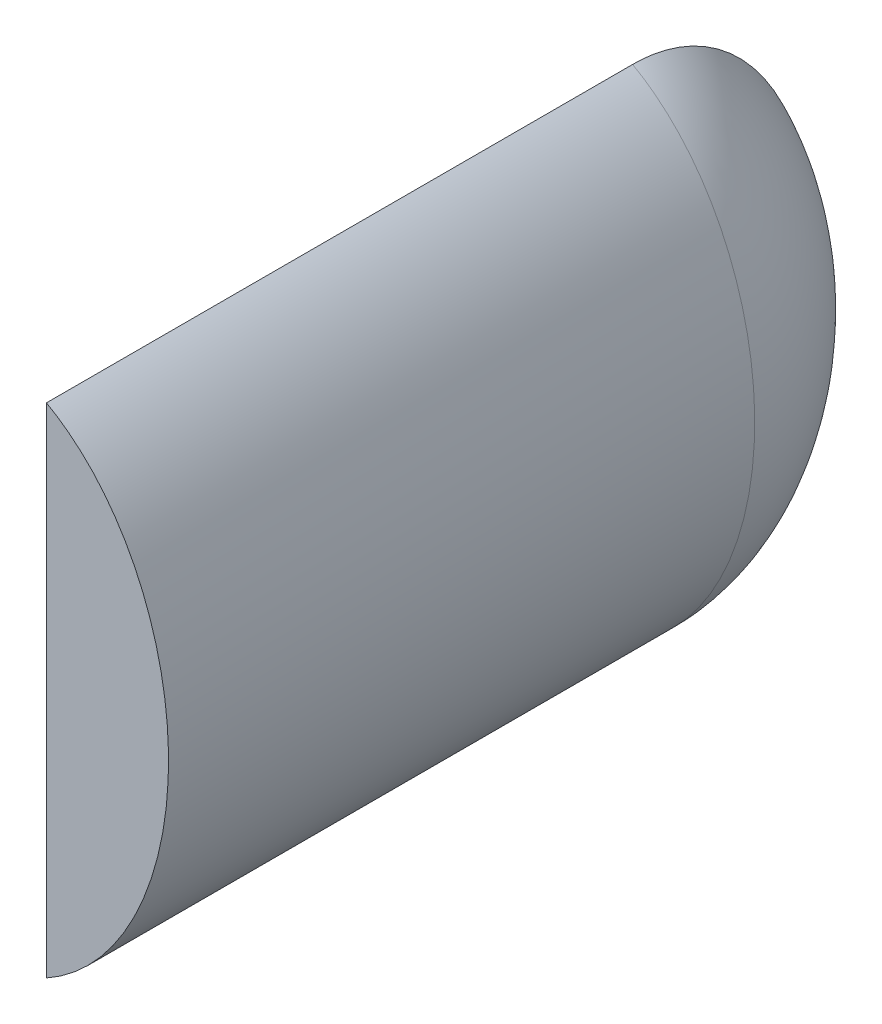
ISO-10303-21;
HEADER;
FILE_DESCRIPTION(('STEP AP214'),'2;1');
FILE_NAME('part.step','',(''),(''),'','','');
FILE_SCHEMA(('AUTOMOTIVE_DESIGN { 1 0 10303 214 1 1 1 1 }'));
ENDSEC;
DATA;
#1=APPLICATION_CONTEXT('core data for automotive mechanical design processes');
#2=APPLICATION_PROTOCOL_DEFINITION('international standard','automotive_design',2000,#1);
#3=PRODUCT_CONTEXT('',#1,'mechanical');
#4=PRODUCT('Part','Part','',(#3));
#5=PRODUCT_RELATED_PRODUCT_CATEGORY('part','',(#4));
#6=PRODUCT_DEFINITION_FORMATION('','',#4);
#7=PRODUCT_DEFINITION_CONTEXT('part definition',#1,'design');
#8=PRODUCT_DEFINITION('design','',#6,#7);
#9=PRODUCT_DEFINITION_SHAPE('','',#8);
#10=(LENGTH_UNIT() NAMED_UNIT(*) SI_UNIT(.MILLI.,.METRE.));
#11=(NAMED_UNIT(*) PLANE_ANGLE_UNIT() SI_UNIT($,.RADIAN.));
#12=(NAMED_UNIT(*) SI_UNIT($,.STERADIAN.) SOLID_ANGLE_UNIT());
#13=UNCERTAINTY_MEASURE_WITH_UNIT(LENGTH_MEASURE(1.E-05),#10,'distance_accuracy_value','');
#14=(GEOMETRIC_REPRESENTATION_CONTEXT(3) GLOBAL_UNCERTAINTY_ASSIGNED_CONTEXT((#13)) GLOBAL_UNIT_ASSIGNED_CONTEXT((#10,
#11,#12)) REPRESENTATION_CONTEXT('',''));
#15=CARTESIAN_POINT('',(0.,0.,0.));
#16=DIRECTION('',(0.,0.,1.));
#17=DIRECTION('',(1.,0.,0.));
#18=AXIS2_PLACEMENT_3D('',#15,#16,#17);
#19=CARTESIAN_POINT('',(15.,0.,0.));
#20=DIRECTION('',(1.,0.,0.));
#21=DIRECTION('',(0.,0.,-1.));
#22=AXIS2_PLACEMENT_3D('',#19,#20,#21);
#23=PLANE('',#22);
#24=DIRECTION('',(0.,0.,1.));
#25=VECTOR('',#24,1.);
#26=CARTESIAN_POINT('',(15.,-50.9863645987827,-120.));
#27=LINE('',#26,#25);
#28=CARTESIAN_POINT('',(15.,-50.9863645987827,-120.));
#29=VERTEX_POINT('',#28);
#30=CARTESIAN_POINT('',(15.,-50.9863645987827,0.));
#31=VERTEX_POINT('',#30);
#32=EDGE_CURVE('E45',#29,#31,#27,.T.);
#33=ORIENTED_EDGE('',*,*,#32,.T.);
#34=DIRECTION('',(0.,1.,0.));
#35=VECTOR('',#34,1.);
#36=CARTESIAN_POINT('',(15.,0.,0.));
#37=LINE('',#36,#35);
#38=CARTESIAN_POINT('',(15.,50.9863645987827,0.));
#39=VERTEX_POINT('',#38);
#40=EDGE_CURVE('E11',#31,#39,#37,.T.);
#41=ORIENTED_EDGE('',*,*,#40,.T.);
#42=DIRECTION('',(0.,0.,1.));
#43=VECTOR('',#42,1.);
#44=CARTESIAN_POINT('',(15.,50.9863645987827,-120.));
#45=LINE('',#44,#43);
#46=CARTESIAN_POINT('',(15.,50.9863645987827,-120.));
#47=VERTEX_POINT('',#46);
#48=EDGE_CURVE('E58',#39,#47,#45,.F.);
#49=ORIENTED_EDGE('',*,*,#48,.T.);
#50=CARTESIAN_POINT('',(15.,-50.9863645987827,-120.));
#51=CARTESIAN_POINT('',(15.,-50.9863659150804,-120.271161514491));
#52=CARTESIAN_POINT('',(15.,-50.9822743336061,-120.542306159468));
#53=CARTESIAN_POINT('',(15.,-50.965922837957,-121.084346800252));
#54=CARTESIAN_POINT('',(15.,-50.9536629928537,-121.355242798143));
#55=CARTESIAN_POINT('',(15.,-50.9046811999531,-122.166843879696));
#56=CARTESIAN_POINT('',(15.,-50.8557569363576,-122.706861864835));
#57=CARTESIAN_POINT('',(15.,-50.7257913423353,-123.782862469057));
#58=CARTESIAN_POINT('',(15.,-50.6447567013706,-124.318845904962));
#59=CARTESIAN_POINT('',(15.,-50.4519432582784,-125.381314381962));
#60=CARTESIAN_POINT('',(15.,-50.3403872606537,-125.907839868435));
#61=CARTESIAN_POINT('',(15.,-50.0871698770449,-126.953650190733));
#62=CARTESIAN_POINT('',(15.,-49.945505098991,-127.4729342037));
#63=CARTESIAN_POINT('',(15.,-49.6331609206117,-128.502696390934));
#64=CARTESIAN_POINT('',(15.,-49.4624811148031,-129.013174442028));
#65=CARTESIAN_POINT('',(15.,-49.0937680987219,-130.022808794033));
#66=CARTESIAN_POINT('',(15.,-48.8957986564226,-130.52198841931));
#67=CARTESIAN_POINT('',(15.,-48.4735499645837,-131.50906343519));
#68=CARTESIAN_POINT('',(15.,-48.2492713099622,-131.996959080654));
#69=CARTESIAN_POINT('',(15.,-47.7758176133993,-132.960470298102));
#70=CARTESIAN_POINT('',(15.,-47.5266438219397,-133.436086485374));
#71=CARTESIAN_POINT('',(15.,-47.0043837486491,-134.375057751137));
#72=CARTESIAN_POINT('',(15.,-46.7312569695623,-134.838390270198));
#73=CARTESIAN_POINT('',(15.,-46.1628988928502,-135.751303292431));
#74=CARTESIAN_POINT('',(15.,-45.8676670614398,-136.200883463147));
#75=CARTESIAN_POINT('',(15.,-45.2565331526422,-137.08579129184));
#76=CARTESIAN_POINT('',(15.,-44.9406283343639,-137.521117048393));
#77=CARTESIAN_POINT('',(15.,-43.9276212878261,-138.852914958976));
#78=CARTESIAN_POINT('',(15.,-43.1970484575742,-139.724212667999));
#79=CARTESIAN_POINT('',(15.,-41.6623561681202,-141.399307441977));
#80=CARTESIAN_POINT('',(15.,-40.8582125209794,-142.203082139527));
#81=CARTESIAN_POINT('',(15.,-39.1862312354968,-143.743776286257));
#82=CARTESIAN_POINT('',(15.,-38.3183027287411,-144.480596876671));
#83=CARTESIAN_POINT('',(15.,-36.5295375571028,-145.886588056753));
#84=CARTESIAN_POINT('',(15.,-35.6086996379795,-146.555757041671));
#85=CARTESIAN_POINT('',(15.,-33.3917139931399,-148.050674904412));
#86=CARTESIAN_POINT('',(15.,-32.0771130208873,-148.849134853375));
#87=CARTESIAN_POINT('',(15.,-29.3834631546804,-150.328860060758));
#88=CARTESIAN_POINT('',(15.,-28.0043917427083,-151.010083976551));
#89=CARTESIAN_POINT('',(15.,-25.1947058469138,-152.259690322041));
#90=CARTESIAN_POINT('',(15.,-23.7640447259047,-152.827967464834));
#91=CARTESIAN_POINT('',(15.,-20.8641465225682,-153.854502689836));
#92=CARTESIAN_POINT('',(15.,-19.3949134372143,-154.312772121932));
#93=CARTESIAN_POINT('',(15.,-16.3900909943441,-155.132720076065));
#94=CARTESIAN_POINT('',(15.,-14.8537620935086,-155.491679567055));
#95=CARTESIAN_POINT('',(15.,-11.7595395006699,-156.100072774864));
#96=CARTESIAN_POINT('',(15.,-10.2016439950094,-156.349497221834));
#97=CARTESIAN_POINT('',(15.,-7.07495705764748,-156.740350126199));
#98=CARTESIAN_POINT('',(15.,-5.50618725920234,-156.881952164787));
#99=CARTESIAN_POINT('',(15.,-2.36304993871342,-157.058877807957));
#100=CARTESIAN_POINT('',(15.,-0.788683565493083,-157.094222090644));
#101=CARTESIAN_POINT('',(15.,2.67030566299415,-157.055482299435));
#102=CARTESIAN_POINT('',(15.,4.55471468743005,-156.958376092501));
#103=CARTESIAN_POINT('',(15.,8.31145838160758,-156.610927943543));
#104=CARTESIAN_POINT('',(15.,10.1837778196358,-156.360420682411));
#105=CARTESIAN_POINT('',(15.,13.8187907961272,-155.717851907121));
#106=CARTESIAN_POINT('',(15.,15.5826749898813,-155.332527605223));
#107=CARTESIAN_POINT('',(15.,19.073289952585,-154.415170127074));
#108=CARTESIAN_POINT('',(15.,20.8000034905659,-153.883070425363));
#109=CARTESIAN_POINT('',(15.,23.3488662050943,-152.971499933035));
#110=CARTESIAN_POINT('',(15.,24.1916190823228,-152.648739656397));
#111=CARTESIAN_POINT('',(15.,25.8614021816744,-151.964571920841));
#112=CARTESIAN_POINT('',(15.,26.6884320009616,-151.603163473298));
#113=CARTESIAN_POINT('',(15.,28.3237033620683,-150.841162648469));
#114=CARTESIAN_POINT('',(15.,29.1319552099297,-150.440592424973));
#115=CARTESIAN_POINT('',(15.,30.7272075977969,-149.599363980685));
#116=CARTESIAN_POINT('',(15.,31.5142101347248,-149.158709543965));
#117=CARTESIAN_POINT('',(15.,33.2760544644224,-148.110192116555));
#118=CARTESIAN_POINT('',(15.,34.2433863512131,-147.48956390627));
#119=CARTESIAN_POINT('',(15.,35.6588109126154,-146.507904097051));
#120=CARTESIAN_POINT('',(15.,36.1246676753095,-146.17224941034));
#121=CARTESIAN_POINT('',(15.,37.043726609915,-145.48369349881));
#122=CARTESIAN_POINT('',(15.,37.4969240869991,-145.130786005619));
#123=CARTESIAN_POINT('',(15.,38.8344130526019,-144.047094310885));
#124=CARTESIAN_POINT('',(15.,39.6979692833804,-143.290397221608));
#125=CARTESIAN_POINT('',(15.,41.3589165422492,-141.707858090598));
#126=CARTESIAN_POINT('',(15.,42.1563353679782,-140.882045394473));
#127=CARTESIAN_POINT('',(15.,43.3196175534746,-139.563262251421));
#128=CARTESIAN_POINT('',(15.,43.7133224366099,-139.094656292022));
#129=CARTESIAN_POINT('',(15.,44.4767078188257,-138.138270137249));
#130=CARTESIAN_POINT('',(15.,44.8463906578662,-137.650491816884));
#131=CARTESIAN_POINT('',(15.,45.55971181131,-136.656236521736));
#132=CARTESIAN_POINT('',(15.,45.9033502615426,-136.149759644491));
#133=CARTESIAN_POINT('',(15.,46.5617303280499,-135.11997699924));
#134=CARTESIAN_POINT('',(15.,46.8765368642458,-134.596712809932));
#135=CARTESIAN_POINT('',(15.,47.476028928893,-133.533147359006));
#136=CARTESIAN_POINT('',(15.,47.7607131488463,-132.992845358597));
#137=CARTESIAN_POINT('',(15.,48.2978319166742,-131.896393391586));
#138=CARTESIAN_POINT('',(15.,48.5502654451368,-131.340242924709));
#139=CARTESIAN_POINT('',(15.,49.021330323174,-130.212336821988));
#140=CARTESIAN_POINT('',(15.,49.2398858591545,-129.640549461005));
#141=CARTESIAN_POINT('',(15.,49.6405726036948,-128.484342282741));
#142=CARTESIAN_POINT('',(15.,49.8227046307503,-127.899922749651));
#143=CARTESIAN_POINT('',(15.,50.1487775434552,-126.720615313501));
#144=CARTESIAN_POINT('',(15.,50.2927253766285,-126.125729335818));
#145=CARTESIAN_POINT('',(15.,50.5422952532679,-124.921545534033));
#146=CARTESIAN_POINT('',(15.,50.6475054986138,-124.312162287949));
#147=CARTESIAN_POINT('',(15.,50.8163766625747,-123.087390674623));
#148=CARTESIAN_POINT('',(15.,50.8800235333674,-122.472000348327));
#149=CARTESIAN_POINT('',(15.,50.9437767050774,-121.546514580511));
#150=CARTESIAN_POINT('',(15.,50.9597416135474,-121.237438966141));
#151=CARTESIAN_POINT('',(15.,50.9810367620806,-120.618917251271));
#152=CARTESIAN_POINT('',(15.,50.9863668492681,-120.309471145509));
#153=CARTESIAN_POINT('',(15.,50.9863645987827,-120.));
#154=B_SPLINE_CURVE_WITH_KNOTS('',3,(#50,#51,#52,#53,#54,#55,#56,#57,#58,#59,#60,#61,#62,#63,
#64,#65,#66,#67,#68,#69,#70,#71,#72,#73,#74,#75,#76,#77,#78,#79,#80,#81,#82,#83,#84,#85,#86,#87,
#88,#89,#90,#91,#92,#93,#94,#95,#96,#97,#98,#99,#100,#101,#102,#103,#104,#105,#106,#107,#108,
#109,#110,#111,#112,#113,#114,#115,#116,#117,#118,#119,#120,#121,#122,#123,#124,#125,#126,#127,
#128,#129,#130,#131,#132,#133,#134,#135,#136,#137,#138,#139,#140,#141,#142,#143,#144,#145,#146,
#147,#148,#149,#150,#151,#152,#153),.UNSPECIFIED.,.F.,.F.,(4,2,2,2,2,2,2,2,2,2,2,2,2,2,2,2,2,2,
2,2,2,2,2,2,2,2,2,2,2,2,2,2,2,2,2,2,2,2,2,2,2,2,2,2,2,2,2,2,2,2,2,4),(0.,0.813420114523437,
1.62683335077322,3.25246235384395,4.87775287222383,6.4914816109913,8.10539224967311,
9.71932544451007,11.3295493319955,12.9397368152507,14.5498434594755,16.1627268153154,
17.7756491310682,19.3887857282241,22.7946790214678,26.2016961248075,29.6136646656911,
33.0257141221767,37.6332785105123,42.2424644157912,46.8559269728315,51.4689133377508,
56.1979126056174,60.9273120071567,65.6490814488548,70.369931959355,76.0243511296297,
81.6848747734549,87.0955105904539,92.5086028011025,95.2151482773809,97.9217630040741,
100.626855364069,103.331692619613,106.776463149462,108.498675105532,110.221517502891,
113.662229211973,117.101487378585,118.936959104074,120.772251769513,122.607534862708,
124.43857832267,126.269701289599,128.100882122178,129.936103459349,131.771283551465,
133.606129507509,135.459953065442,137.314402865207,138.242707324227,139.171025127549),.UNSPECIFIED.);
#155=EDGE_CURVE('E37',#29,#47,#154,.T.);
#156=ORIENTED_EDGE('',*,*,#155,.F.);
#157=EDGE_LOOP('',(#33,#41,#49,#156));
#158=FACE_BOUND('',#157,.T.);
#159=ADVANCED_FACE('F33',(#158),#23,.F.);
#160=CARTESIAN_POINT('',(0.,0.,-120.));
#161=DIRECTION('',(0.,0.,1.));
#162=DIRECTION('',(0.,-1.,0.));
#163=AXIS2_PLACEMENT_3D('',#160,#161,#162);
#164=ELLIPSE('',#163,55.,40.);
#165=DIRECTION('',(0.,0.,1.));
#166=VECTOR('',#165,1.);
#167=SURFACE_OF_LINEAR_EXTRUSION('',#164,#166);
#168=ORIENTED_EDGE('',*,*,#48,.F.);
#169=CARTESIAN_POINT('',(0.,0.,0.));
#170=DIRECTION('',(0.,0.,1.));
#171=DIRECTION('',(0.,-1.,0.));
#172=AXIS2_PLACEMENT_3D('',#169,#170,#171);
#173=ELLIPSE('',#172,55.,40.);
#174=EDGE_CURVE('E70',#31,#39,#173,.T.);
#175=ORIENTED_EDGE('',*,*,#174,.F.);
#176=ORIENTED_EDGE('',*,*,#32,.F.);
#177=CARTESIAN_POINT('',(0.,0.,-120.));
#178=DIRECTION('',(0.,0.,1.));
#179=DIRECTION('',(0.,-1.,0.));
#180=AXIS2_PLACEMENT_3D('',#177,#178,#179);
#181=ELLIPSE('',#180,55.,40.);
#182=EDGE_CURVE('E68',#29,#47,#181,.T.);
#183=ORIENTED_EDGE('',*,*,#182,.T.);
#184=EDGE_LOOP('',(#168,#175,#176,#183));
#185=FACE_BOUND('',#184,.T.);
#186=ADVANCED_FACE('F69',(#185),#167,.T.);
#187=CARTESIAN_POINT('',(0.,-55.,-120.));
#188=CARTESIAN_POINT('',(0.,-55.,-160.));
#189=CARTESIAN_POINT('',(0.,0.,-160.));
#190=CARTESIAN_POINT('',(80.,-55.,-120.));
#191=CARTESIAN_POINT('',(80.,-55.,-160.));
#192=CARTESIAN_POINT('',(0.,0.,-160.));
#193=CARTESIAN_POINT('',(80.,55.,-120.));
#194=CARTESIAN_POINT('',(80.,55.,-160.));
#195=CARTESIAN_POINT('',(0.,0.,-160.));
#196=CARTESIAN_POINT('',(0.,55.,-120.));
#197=CARTESIAN_POINT('',(0.,55.,-160.));
#198=CARTESIAN_POINT('',(0.,0.,-160.));
#199=CARTESIAN_POINT('',(-80.,55.,-120.));
#200=CARTESIAN_POINT('',(-80.,55.,-160.));
#201=CARTESIAN_POINT('',(0.,0.,-160.));
#202=CARTESIAN_POINT('',(-80.,-55.,-120.));
#203=CARTESIAN_POINT('',(-80.,-55.,-160.));
#204=CARTESIAN_POINT('',(0.,0.,-160.));
#205=CARTESIAN_POINT('',(0.,-55.,-120.));
#206=CARTESIAN_POINT('',(0.,-55.,-160.));
#207=CARTESIAN_POINT('',(0.,0.,-160.));
#208=(BOUNDED_SURFACE() B_SPLINE_SURFACE(3,2,((#187,#188,#189),(#190,#191,#192),(#193,#194,
#195),(#196,#197,#198),(#199,#200,#201),(#202,#203,#204),(#205,#206,#207)),.UNSPECIFIED.,.T.,
.F.,.F.) B_SPLINE_SURFACE_WITH_KNOTS((4,3,4),(3,3),(0.,0.5,1.),(0.,1.),
.UNSPECIFIED.) GEOMETRIC_REPRESENTATION_ITEM() RATIONAL_B_SPLINE_SURFACE(((1.,0.707106781186548,
1.),(0.333333333333333,0.235702260395516,0.333333333333333),(0.333333333333333,
0.235702260395516,0.333333333333333),(1.,0.707106781186548,1.),(0.333333333333333,
0.235702260395516,0.333333333333333),(0.333333333333333,0.235702260395516,0.333333333333333),
(1.,0.707106781186548,1.))) REPRESENTATION_ITEM('') SURFACE());
#209=ORIENTED_EDGE('',*,*,#182,.F.);
#210=ORIENTED_EDGE('',*,*,#155,.T.);
#211=EDGE_LOOP('',(#209,#210));
#212=FACE_BOUND('',#211,.T.);
#213=ADVANCED_FACE('F72',(#212),#208,.F.);
#214=CARTESIAN_POINT('',(0.,0.,0.));
#215=DIRECTION('',(0.,0.,1.));
#216=DIRECTION('',(1.,0.,0.));
#217=AXIS2_PLACEMENT_3D('',#214,#215,#216);
#218=PLANE('',#217);
#219=ORIENTED_EDGE('',*,*,#40,.F.);
#220=ORIENTED_EDGE('',*,*,#174,.T.);
#221=EDGE_LOOP('',(#219,#220));
#222=FACE_BOUND('',#221,.T.);
#223=ADVANCED_FACE('F80',(#222),#218,.T.);
#224=CLOSED_SHELL('',(#159,#186,#213,#223));
#225=MANIFOLD_SOLID_BREP('B2',#224);
#226=ADVANCED_BREP_SHAPE_REPRESENTATION('',(#18,#225),#14);
#227=SHAPE_DEFINITION_REPRESENTATION(#9,#226);
ENDSEC;
END-ISO-10303-21;
